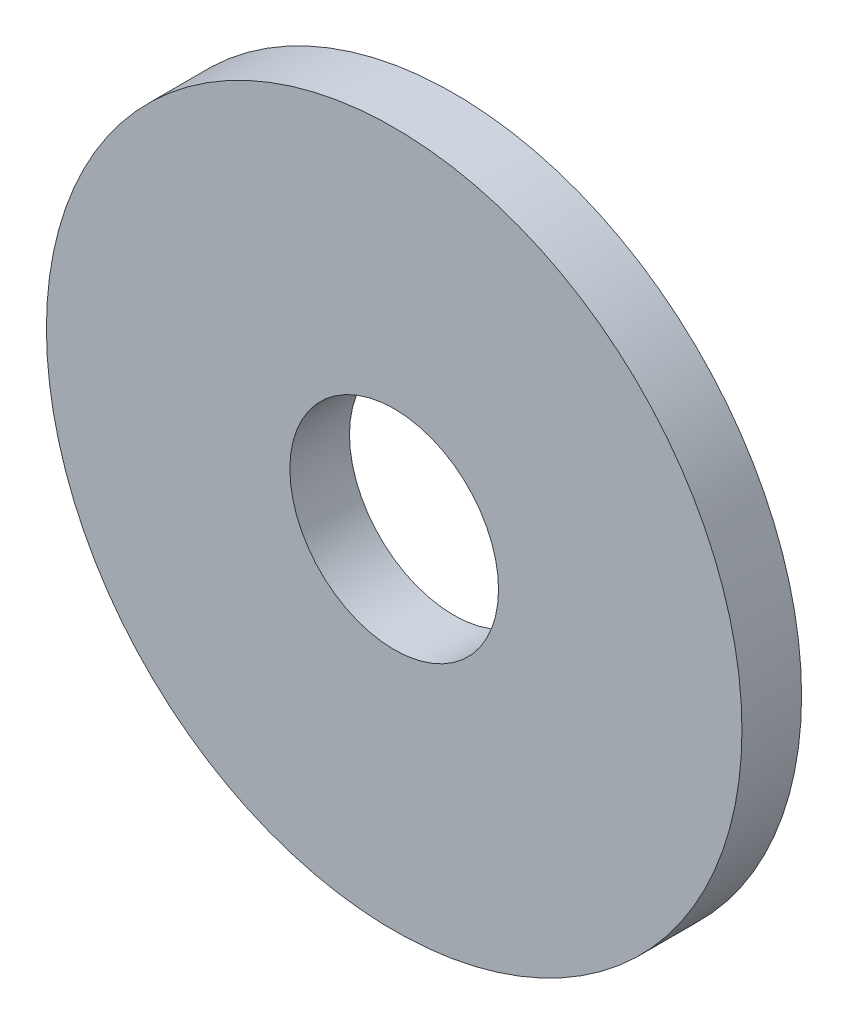
ISO-10303-21;
HEADER;
FILE_DESCRIPTION(('STEP AP214'),'2;1');
FILE_NAME('part.step','',(''),(''),'','','');
FILE_SCHEMA(('AUTOMOTIVE_DESIGN { 1 0 10303 214 1 1 1 1 }'));
ENDSEC;
DATA;
#1=APPLICATION_CONTEXT('core data for automotive mechanical design processes');
#2=APPLICATION_PROTOCOL_DEFINITION('international standard','automotive_design',2000,#1);
#3=PRODUCT_CONTEXT('',#1,'mechanical');
#4=PRODUCT('Part','Part','',(#3));
#5=PRODUCT_RELATED_PRODUCT_CATEGORY('part','',(#4));
#6=PRODUCT_DEFINITION_FORMATION('','',#4);
#7=PRODUCT_DEFINITION_CONTEXT('part definition',#1,'design');
#8=PRODUCT_DEFINITION('design','',#6,#7);
#9=PRODUCT_DEFINITION_SHAPE('','',#8);
#10=(LENGTH_UNIT() NAMED_UNIT(*) SI_UNIT(.MILLI.,.METRE.));
#11=(NAMED_UNIT(*) PLANE_ANGLE_UNIT() SI_UNIT($,.RADIAN.));
#12=(NAMED_UNIT(*) SI_UNIT($,.STERADIAN.) SOLID_ANGLE_UNIT());
#13=UNCERTAINTY_MEASURE_WITH_UNIT(LENGTH_MEASURE(1.E-05),#10,'distance_accuracy_value','');
#14=(GEOMETRIC_REPRESENTATION_CONTEXT(3) GLOBAL_UNCERTAINTY_ASSIGNED_CONTEXT((#13)) GLOBAL_UNIT_ASSIGNED_CONTEXT((#10,
#11,#12)) REPRESENTATION_CONTEXT('',''));
#15=CARTESIAN_POINT('',(0.,0.,0.));
#16=DIRECTION('',(0.,0.,1.));
#17=DIRECTION('',(1.,0.,0.));
#18=AXIS2_PLACEMENT_3D('',#15,#16,#17);
#19=CARTESIAN_POINT('',(0.,-155.807573628499,3.));
#20=DIRECTION('',(0.,0.,1.));
#21=DIRECTION('',(1.,0.,0.));
#22=AXIS2_PLACEMENT_3D('',#19,#20,#21);
#23=PLANE('',#22);
#24=CARTESIAN_POINT('',(0.,-155.807573628499,3.));
#25=DIRECTION('',(0.,0.,1.));
#26=DIRECTION('',(1.,0.,0.));
#27=AXIS2_PLACEMENT_3D('',#24,#25,#26);
#28=CIRCLE('',#27,17.5);
#29=CARTESIAN_POINT('',(17.5,-155.807573628499,3.));
#30=VERTEX_POINT('',#29);
#31=EDGE_CURVE('E12',#30,#30,#28,.T.);
#32=ORIENTED_EDGE('',*,*,#31,.T.);
#33=EDGE_LOOP('',(#32));
#34=FACE_BOUND('',#33,.T.);
#35=CARTESIAN_POINT('',(0.,-155.807573628499,3.));
#36=DIRECTION('',(0.,0.,1.));
#37=DIRECTION('',(1.,0.,0.));
#38=AXIS2_PLACEMENT_3D('',#35,#36,#37);
#39=CIRCLE('',#38,5.25);
#40=CARTESIAN_POINT('',(5.25,-155.807573628499,3.));
#41=VERTEX_POINT('',#40);
#42=EDGE_CURVE('E55',#41,#41,#39,.T.);
#43=ORIENTED_EDGE('',*,*,#42,.F.);
#44=EDGE_LOOP('',(#43));
#45=FACE_BOUND('',#44,.T.);
#46=ADVANCED_FACE('F44',(#34,#45),#23,.T.);
#47=CARTESIAN_POINT('',(0.,-155.807573628499,0.));
#48=DIRECTION('',(0.,0.,1.));
#49=DIRECTION('',(1.,0.,0.));
#50=AXIS2_PLACEMENT_3D('',#47,#48,#49);
#51=PLANE('',#50);
#52=CARTESIAN_POINT('',(0.,-155.807573628499,0.));
#53=DIRECTION('',(0.,0.,1.));
#54=DIRECTION('',(1.,0.,0.));
#55=AXIS2_PLACEMENT_3D('',#52,#53,#54);
#56=CIRCLE('',#55,17.5);
#57=CARTESIAN_POINT('',(17.5,-155.807573628499,0.));
#58=VERTEX_POINT('',#57);
#59=EDGE_CURVE('E48',#58,#58,#56,.T.);
#60=ORIENTED_EDGE('',*,*,#59,.F.);
#61=EDGE_LOOP('',(#60));
#62=FACE_BOUND('',#61,.T.);
#63=CARTESIAN_POINT('',(0.,-155.807573628499,0.));
#64=DIRECTION('',(0.,0.,1.));
#65=DIRECTION('',(1.,0.,0.));
#66=AXIS2_PLACEMENT_3D('',#63,#64,#65);
#67=CIRCLE('',#66,5.25);
#68=CARTESIAN_POINT('',(5.25,-155.807573628499,0.));
#69=VERTEX_POINT('',#68);
#70=EDGE_CURVE('E57',#69,#69,#67,.T.);
#71=ORIENTED_EDGE('',*,*,#70,.T.);
#72=EDGE_LOOP('',(#71));
#73=FACE_BOUND('',#72,.T.);
#74=ADVANCED_FACE('F67',(#62,#73),#51,.F.);
#75=CARTESIAN_POINT('',(0.,-155.807573628499,3.));
#76=DIRECTION('',(0.,0.,-1.));
#77=DIRECTION('',(-1.,0.,0.));
#78=AXIS2_PLACEMENT_3D('',#75,#76,#77);
#79=CYLINDRICAL_SURFACE('',#78,17.5);
#80=ORIENTED_EDGE('',*,*,#31,.F.);
#81=EDGE_LOOP('',(#80));
#82=FACE_BOUND('',#81,.T.);
#83=ORIENTED_EDGE('',*,*,#59,.T.);
#84=EDGE_LOOP('',(#83));
#85=FACE_BOUND('',#84,.T.);
#86=ADVANCED_FACE('F46',(#82,#85),#79,.T.);
#87=CARTESIAN_POINT('',(0.,-155.807573628499,3.));
#88=DIRECTION('',(0.,0.,-1.));
#89=DIRECTION('',(-1.,0.,0.));
#90=AXIS2_PLACEMENT_3D('',#87,#88,#89);
#91=CYLINDRICAL_SURFACE('',#90,5.25);
#92=ORIENTED_EDGE('',*,*,#42,.T.);
#93=EDGE_LOOP('',(#92));
#94=FACE_BOUND('',#93,.T.);
#95=ORIENTED_EDGE('',*,*,#70,.F.);
#96=EDGE_LOOP('',(#95));
#97=FACE_BOUND('',#96,.T.);
#98=ADVANCED_FACE('F63',(#94,#97),#91,.F.);
#99=CLOSED_SHELL('',(#46,#74,#86,#98));
#100=MANIFOLD_SOLID_BREP('B2',#99);
#101=ADVANCED_BREP_SHAPE_REPRESENTATION('',(#18,#100),#14);
#102=SHAPE_DEFINITION_REPRESENTATION(#9,#101);
ENDSEC;
END-ISO-10303-21;
